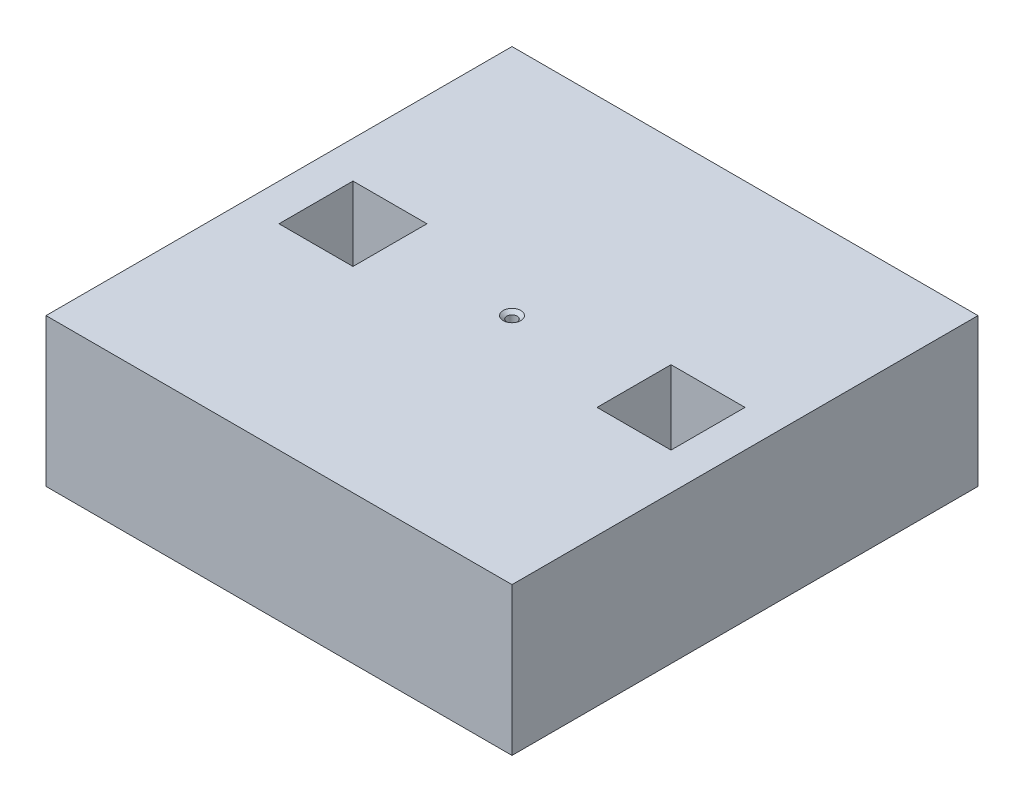
ISO-10303-21;
HEADER;
FILE_DESCRIPTION(('STEP AP214'),'2;1');
FILE_NAME('part.step','',(''),(''),'','','');
FILE_SCHEMA(('AUTOMOTIVE_DESIGN { 1 0 10303 214 1 1 1 1 }'));
ENDSEC;
DATA;
#1=APPLICATION_CONTEXT('core data for automotive mechanical design processes');
#2=APPLICATION_PROTOCOL_DEFINITION('international standard','automotive_design',2000,#1);
#3=PRODUCT_CONTEXT('',#1,'mechanical');
#4=PRODUCT('Part','Part','',(#3));
#5=PRODUCT_RELATED_PRODUCT_CATEGORY('part','',(#4));
#6=PRODUCT_DEFINITION_FORMATION('','',#4);
#7=PRODUCT_DEFINITION_CONTEXT('part definition',#1,'design');
#8=PRODUCT_DEFINITION('design','',#6,#7);
#9=PRODUCT_DEFINITION_SHAPE('','',#8);
#10=(LENGTH_UNIT() NAMED_UNIT(*) SI_UNIT(.MILLI.,.METRE.));
#11=(NAMED_UNIT(*) PLANE_ANGLE_UNIT() SI_UNIT($,.RADIAN.));
#12=(NAMED_UNIT(*) SI_UNIT($,.STERADIAN.) SOLID_ANGLE_UNIT());
#13=UNCERTAINTY_MEASURE_WITH_UNIT(LENGTH_MEASURE(1.E-05),#10,'distance_accuracy_value','');
#14=(GEOMETRIC_REPRESENTATION_CONTEXT(3) GLOBAL_UNCERTAINTY_ASSIGNED_CONTEXT((#13)) GLOBAL_UNIT_ASSIGNED_CONTEXT((#10,
#11,#12)) REPRESENTATION_CONTEXT('',''));
#15=CARTESIAN_POINT('',(0.,0.,0.));
#16=DIRECTION('',(0.,0.,1.));
#17=DIRECTION('',(1.,0.,0.));
#18=AXIS2_PLACEMENT_3D('',#15,#16,#17);
#19=CARTESIAN_POINT('',(0.,25.4,0.));
#20=DIRECTION('',(0.,1.,0.));
#21=DIRECTION('',(0.,0.,1.));
#22=AXIS2_PLACEMENT_3D('',#19,#20,#21);
#23=PLANE('',#22);
#24=CARTESIAN_POINT('',(0.,25.4,0.));
#25=DIRECTION('',(0.,1.,0.));
#26=DIRECTION('',(0.,0.,1.));
#27=AXIS2_PLACEMENT_3D('',#24,#25,#26);
#28=CIRCLE('',#27,1.5113);
#29=CARTESIAN_POINT('',(0.,25.4,1.5113));
#30=VERTEX_POINT('',#29);
#31=EDGE_CURVE('E312',#30,#30,#28,.T.);
#32=ORIENTED_EDGE('',*,*,#31,.F.);
#33=EDGE_LOOP('',(#32));
#34=FACE_BOUND('',#33,.T.);
#35=DIRECTION('',(0.,0.,-1.));
#36=VECTOR('',#35,1.);
#37=CARTESIAN_POINT('',(40.,25.4,-40.));
#38=LINE('',#37,#36);
#39=CARTESIAN_POINT('',(40.,25.4,40.));
#40=VERTEX_POINT('',#39);
#41=CARTESIAN_POINT('',(40.,25.4,-40.));
#42=VERTEX_POINT('',#41);
#43=EDGE_CURVE('E192',#40,#42,#38,.T.);
#44=ORIENTED_EDGE('',*,*,#43,.T.);
#45=DIRECTION('',(-1.,0.,0.));
#46=VECTOR('',#45,1.);
#47=CARTESIAN_POINT('',(-40.,25.4,-40.));
#48=LINE('',#47,#46);
#49=CARTESIAN_POINT('',(-40.,25.4,-40.));
#50=VERTEX_POINT('',#49);
#51=EDGE_CURVE('E195',#42,#50,#48,.T.);
#52=ORIENTED_EDGE('',*,*,#51,.T.);
#53=DIRECTION('',(0.,0.,1.));
#54=VECTOR('',#53,1.);
#55=CARTESIAN_POINT('',(-40.,25.4,-40.));
#56=LINE('',#55,#54);
#57=CARTESIAN_POINT('',(-40.,25.4,40.));
#58=VERTEX_POINT('',#57);
#59=EDGE_CURVE('E198',#50,#58,#56,.T.);
#60=ORIENTED_EDGE('',*,*,#59,.T.);
#61=DIRECTION('',(1.,0.,0.));
#62=VECTOR('',#61,1.);
#63=CARTESIAN_POINT('',(-40.,25.4,40.));
#64=LINE('',#63,#62);
#65=EDGE_CURVE('E200',#58,#40,#64,.T.);
#66=ORIENTED_EDGE('',*,*,#65,.T.);
#67=EDGE_LOOP('',(#44,#52,#60,#66));
#68=FACE_BOUND('',#67,.T.);
#69=DIRECTION('',(-1.,0.,0.));
#70=VECTOR('',#69,1.);
#71=CARTESIAN_POINT('',(-33.65,25.4,-6.35));
#72=LINE('',#71,#70);
#73=CARTESIAN_POINT('',(-20.95,25.4,-6.35));
#74=VERTEX_POINT('',#73);
#75=CARTESIAN_POINT('',(-33.65,25.4,-6.35));
#76=VERTEX_POINT('',#75);
#77=EDGE_CURVE('E163',#74,#76,#72,.T.);
#78=ORIENTED_EDGE('',*,*,#77,.F.);
#79=DIRECTION('',(0.,0.,-1.));
#80=VECTOR('',#79,1.);
#81=CARTESIAN_POINT('',(-20.95,25.4,6.35));
#82=LINE('',#81,#80);
#83=CARTESIAN_POINT('',(-20.95,25.4,6.35));
#84=VERTEX_POINT('',#83);
#85=EDGE_CURVE('E161',#84,#74,#82,.T.);
#86=ORIENTED_EDGE('',*,*,#85,.F.);
#87=DIRECTION('',(1.,0.,0.));
#88=VECTOR('',#87,1.);
#89=CARTESIAN_POINT('',(-33.65,25.4,6.35));
#90=LINE('',#89,#88);
#91=CARTESIAN_POINT('',(-33.65,25.4,6.35));
#92=VERTEX_POINT('',#91);
#93=EDGE_CURVE('E169',#92,#84,#90,.T.);
#94=ORIENTED_EDGE('',*,*,#93,.F.);
#95=DIRECTION('',(0.,0.,1.));
#96=VECTOR('',#95,1.);
#97=CARTESIAN_POINT('',(-33.65,25.4,6.35));
#98=LINE('',#97,#96);
#99=EDGE_CURVE('E166',#76,#92,#98,.T.);
#100=ORIENTED_EDGE('',*,*,#99,.F.);
#101=EDGE_LOOP('',(#78,#86,#94,#100));
#102=FACE_BOUND('',#101,.T.);
#103=DIRECTION('',(-1.,0.,0.));
#104=VECTOR('',#103,1.);
#105=CARTESIAN_POINT('',(20.95,25.4,-6.35));
#106=LINE('',#105,#104);
#107=CARTESIAN_POINT('',(33.65,25.4,-6.35));
#108=VERTEX_POINT('',#107);
#109=CARTESIAN_POINT('',(20.95,25.4,-6.35));
#110=VERTEX_POINT('',#109);
#111=EDGE_CURVE('E131',#108,#110,#106,.T.);
#112=ORIENTED_EDGE('',*,*,#111,.F.);
#113=DIRECTION('',(0.,0.,-1.));
#114=VECTOR('',#113,1.);
#115=CARTESIAN_POINT('',(33.65,25.4,-6.35));
#116=LINE('',#115,#114);
#117=CARTESIAN_POINT('',(33.65,25.4,6.35));
#118=VERTEX_POINT('',#117);
#119=EDGE_CURVE('E123',#118,#108,#116,.T.);
#120=ORIENTED_EDGE('',*,*,#119,.F.);
#121=DIRECTION('',(1.,0.,0.));
#122=VECTOR('',#121,1.);
#123=CARTESIAN_POINT('',(20.95,25.4,6.35));
#124=LINE('',#123,#122);
#125=CARTESIAN_POINT('',(20.95,25.4,6.35));
#126=VERTEX_POINT('',#125);
#127=EDGE_CURVE('E145',#126,#118,#124,.T.);
#128=ORIENTED_EDGE('',*,*,#127,.F.);
#129=DIRECTION('',(0.,0.,1.));
#130=VECTOR('',#129,1.);
#131=CARTESIAN_POINT('',(20.95,25.4,-6.35));
#132=LINE('',#131,#130);
#133=EDGE_CURVE('E143',#110,#126,#132,.T.);
#134=ORIENTED_EDGE('',*,*,#133,.F.);
#135=EDGE_LOOP('',(#112,#120,#128,#134));
#136=FACE_BOUND('',#135,.T.);
#137=ADVANCED_FACE('F34',(#34,#68,#102,#136),#23,.T.);
#138=CARTESIAN_POINT('',(0.,0.,0.));
#139=DIRECTION('',(0.,1.,0.));
#140=DIRECTION('',(0.,0.,1.));
#141=AXIS2_PLACEMENT_3D('',#138,#139,#140);
#142=PLANE('',#141);
#143=CARTESIAN_POINT('',(0.,0.,0.));
#144=DIRECTION('',(0.,1.,0.));
#145=DIRECTION('',(0.,0.,1.));
#146=AXIS2_PLACEMENT_3D('',#143,#144,#145);
#147=CIRCLE('',#146,0.888999999999994);
#148=CARTESIAN_POINT('',(0.,0.,0.888999999999994));
#149=VERTEX_POINT('',#148);
#150=EDGE_CURVE('E151',#149,#149,#147,.T.);
#151=ORIENTED_EDGE('',*,*,#150,.T.);
#152=EDGE_LOOP('',(#151));
#153=FACE_BOUND('',#152,.T.);
#154=DIRECTION('',(0.,0.,-1.));
#155=VECTOR('',#154,1.);
#156=CARTESIAN_POINT('',(-20.95,0.,6.35));
#157=LINE('',#156,#155);
#158=CARTESIAN_POINT('',(-20.95,0.,6.35));
#159=VERTEX_POINT('',#158);
#160=CARTESIAN_POINT('',(-20.95,0.,-6.35));
#161=VERTEX_POINT('',#160);
#162=EDGE_CURVE('E139',#159,#161,#157,.T.);
#163=ORIENTED_EDGE('',*,*,#162,.T.);
#164=DIRECTION('',(-1.,0.,0.));
#165=VECTOR('',#164,1.);
#166=CARTESIAN_POINT('',(-33.65,0.,-6.35));
#167=LINE('',#166,#165);
#168=CARTESIAN_POINT('',(-33.65,0.,-6.35));
#169=VERTEX_POINT('',#168);
#170=EDGE_CURVE('E174',#161,#169,#167,.T.);
#171=ORIENTED_EDGE('',*,*,#170,.T.);
#172=DIRECTION('',(0.,0.,1.));
#173=VECTOR('',#172,1.);
#174=CARTESIAN_POINT('',(-33.65,0.,6.35));
#175=LINE('',#174,#173);
#176=CARTESIAN_POINT('',(-33.65,0.,6.35));
#177=VERTEX_POINT('',#176);
#178=EDGE_CURVE('E177',#169,#177,#175,.T.);
#179=ORIENTED_EDGE('',*,*,#178,.T.);
#180=DIRECTION('',(1.,0.,0.));
#181=VECTOR('',#180,1.);
#182=CARTESIAN_POINT('',(-33.65,0.,6.35));
#183=LINE('',#182,#181);
#184=EDGE_CURVE('E164',#177,#159,#183,.T.);
#185=ORIENTED_EDGE('',*,*,#184,.T.);
#186=EDGE_LOOP('',(#163,#171,#179,#185));
#187=FACE_BOUND('',#186,.T.);
#188=DIRECTION('',(0.,0.,-1.));
#189=VECTOR('',#188,1.);
#190=CARTESIAN_POINT('',(40.,0.,-40.));
#191=LINE('',#190,#189);
#192=CARTESIAN_POINT('',(40.,0.,40.));
#193=VERTEX_POINT('',#192);
#194=CARTESIAN_POINT('',(40.,0.,-40.));
#195=VERTEX_POINT('',#194);
#196=EDGE_CURVE('E191',#193,#195,#191,.T.);
#197=ORIENTED_EDGE('',*,*,#196,.F.);
#198=DIRECTION('',(1.,0.,0.));
#199=VECTOR('',#198,1.);
#200=CARTESIAN_POINT('',(-40.,0.,40.));
#201=LINE('',#200,#199);
#202=CARTESIAN_POINT('',(-40.,0.,40.));
#203=VERTEX_POINT('',#202);
#204=EDGE_CURVE('E196',#203,#193,#201,.T.);
#205=ORIENTED_EDGE('',*,*,#204,.F.);
#206=DIRECTION('',(0.,0.,1.));
#207=VECTOR('',#206,1.);
#208=CARTESIAN_POINT('',(-40.,0.,-40.));
#209=LINE('',#208,#207);
#210=CARTESIAN_POINT('',(-40.,0.,-40.));
#211=VERTEX_POINT('',#210);
#212=EDGE_CURVE('E207',#211,#203,#209,.T.);
#213=ORIENTED_EDGE('',*,*,#212,.F.);
#214=DIRECTION('',(-1.,0.,0.));
#215=VECTOR('',#214,1.);
#216=CARTESIAN_POINT('',(-40.,0.,-40.));
#217=LINE('',#216,#215);
#218=EDGE_CURVE('E205',#195,#211,#217,.T.);
#219=ORIENTED_EDGE('',*,*,#218,.F.);
#220=EDGE_LOOP('',(#197,#205,#213,#219));
#221=FACE_BOUND('',#220,.T.);
#222=DIRECTION('',(0.,0.,-1.));
#223=VECTOR('',#222,1.);
#224=CARTESIAN_POINT('',(33.65,0.,-6.35));
#225=LINE('',#224,#223);
#226=CARTESIAN_POINT('',(33.65,0.,6.35));
#227=VERTEX_POINT('',#226);
#228=CARTESIAN_POINT('',(33.65,0.,-6.35));
#229=VERTEX_POINT('',#228);
#230=EDGE_CURVE('E57',#227,#229,#225,.T.);
#231=ORIENTED_EDGE('',*,*,#230,.T.);
#232=DIRECTION('',(-1.,0.,0.));
#233=VECTOR('',#232,1.);
#234=CARTESIAN_POINT('',(20.95,0.,-6.35));
#235=LINE('',#234,#233);
#236=CARTESIAN_POINT('',(20.95,0.,-6.35));
#237=VERTEX_POINT('',#236);
#238=EDGE_CURVE('E138',#229,#237,#235,.T.);
#239=ORIENTED_EDGE('',*,*,#238,.T.);
#240=DIRECTION('',(0.,0.,1.));
#241=VECTOR('',#240,1.);
#242=CARTESIAN_POINT('',(20.95,0.,-6.35));
#243=LINE('',#242,#241);
#244=CARTESIAN_POINT('',(20.95,0.,6.35));
#245=VERTEX_POINT('',#244);
#246=EDGE_CURVE('E153',#237,#245,#243,.T.);
#247=ORIENTED_EDGE('',*,*,#246,.T.);
#248=DIRECTION('',(1.,0.,0.));
#249=VECTOR('',#248,1.);
#250=CARTESIAN_POINT('',(20.95,0.,6.35));
#251=LINE('',#250,#249);
#252=EDGE_CURVE('E132',#245,#227,#251,.T.);
#253=ORIENTED_EDGE('',*,*,#252,.T.);
#254=EDGE_LOOP('',(#231,#239,#247,#253));
#255=FACE_BOUND('',#254,.T.);
#256=ADVANCED_FACE('F225',(#153,#187,#221,#255),#142,.F.);
#257=CARTESIAN_POINT('',(40.,25.4,-40.));
#258=DIRECTION('',(-1.,0.,0.));
#259=DIRECTION('',(0.,0.,1.));
#260=AXIS2_PLACEMENT_3D('',#257,#258,#259);
#261=PLANE('',#260);
#262=ORIENTED_EDGE('',*,*,#196,.T.);
#263=DIRECTION('',(0.,-1.,0.));
#264=VECTOR('',#263,1.);
#265=CARTESIAN_POINT('',(40.,25.4,-40.));
#266=LINE('',#265,#264);
#267=EDGE_CURVE('E11',#42,#195,#266,.T.);
#268=ORIENTED_EDGE('',*,*,#267,.F.);
#269=ORIENTED_EDGE('',*,*,#43,.F.);
#270=DIRECTION('',(0.,-1.,0.));
#271=VECTOR('',#270,1.);
#272=CARTESIAN_POINT('',(40.,25.4,40.));
#273=LINE('',#272,#271);
#274=EDGE_CURVE('E202',#40,#193,#273,.T.);
#275=ORIENTED_EDGE('',*,*,#274,.T.);
#276=EDGE_LOOP('',(#262,#268,#269,#275));
#277=FACE_BOUND('',#276,.T.);
#278=ADVANCED_FACE('F36',(#277),#261,.F.);
#279=CARTESIAN_POINT('',(-40.,25.4,-40.));
#280=DIRECTION('',(0.,0.,1.));
#281=DIRECTION('',(1.,0.,0.));
#282=AXIS2_PLACEMENT_3D('',#279,#280,#281);
#283=PLANE('',#282);
#284=ORIENTED_EDGE('',*,*,#218,.T.);
#285=DIRECTION('',(0.,-1.,0.));
#286=VECTOR('',#285,1.);
#287=CARTESIAN_POINT('',(-40.,25.4,-40.));
#288=LINE('',#287,#286);
#289=EDGE_CURVE('E42',#50,#211,#288,.T.);
#290=ORIENTED_EDGE('',*,*,#289,.F.);
#291=ORIENTED_EDGE('',*,*,#51,.F.);
#292=ORIENTED_EDGE('',*,*,#267,.T.);
#293=EDGE_LOOP('',(#284,#290,#291,#292));
#294=FACE_BOUND('',#293,.T.);
#295=ADVANCED_FACE('F236',(#294),#283,.F.);
#296=CARTESIAN_POINT('',(-40.,25.4,-40.));
#297=DIRECTION('',(1.,0.,0.));
#298=DIRECTION('',(0.,0.,-1.));
#299=AXIS2_PLACEMENT_3D('',#296,#297,#298);
#300=PLANE('',#299);
#301=ORIENTED_EDGE('',*,*,#212,.T.);
#302=DIRECTION('',(0.,-1.,0.));
#303=VECTOR('',#302,1.);
#304=CARTESIAN_POINT('',(-40.,25.4,40.));
#305=LINE('',#304,#303);
#306=EDGE_CURVE('E212',#58,#203,#305,.T.);
#307=ORIENTED_EDGE('',*,*,#306,.F.);
#308=ORIENTED_EDGE('',*,*,#59,.F.);
#309=ORIENTED_EDGE('',*,*,#289,.T.);
#310=EDGE_LOOP('',(#301,#307,#308,#309));
#311=FACE_BOUND('',#310,.T.);
#312=ADVANCED_FACE('F219',(#311),#300,.F.);
#313=CARTESIAN_POINT('',(-40.,25.4,40.));
#314=DIRECTION('',(0.,0.,-1.));
#315=DIRECTION('',(-1.,0.,0.));
#316=AXIS2_PLACEMENT_3D('',#313,#314,#315);
#317=PLANE('',#316);
#318=ORIENTED_EDGE('',*,*,#204,.T.);
#319=ORIENTED_EDGE('',*,*,#274,.F.);
#320=ORIENTED_EDGE('',*,*,#65,.F.);
#321=ORIENTED_EDGE('',*,*,#306,.T.);
#322=EDGE_LOOP('',(#318,#319,#320,#321));
#323=FACE_BOUND('',#322,.T.);
#324=ADVANCED_FACE('F229',(#323),#317,.F.);
#325=CARTESIAN_POINT('',(-20.95,25.4,6.35));
#326=DIRECTION('',(-1.,0.,0.));
#327=DIRECTION('',(0.,0.,1.));
#328=AXIS2_PLACEMENT_3D('',#325,#326,#327);
#329=PLANE('',#328);
#330=ORIENTED_EDGE('',*,*,#162,.F.);
#331=DIRECTION('',(0.,-1.,0.));
#332=VECTOR('',#331,1.);
#333=CARTESIAN_POINT('',(-20.95,25.4,6.35));
#334=LINE('',#333,#332);
#335=EDGE_CURVE('E171',#84,#159,#334,.T.);
#336=ORIENTED_EDGE('',*,*,#335,.F.);
#337=ORIENTED_EDGE('',*,*,#85,.T.);
#338=DIRECTION('',(0.,-1.,0.));
#339=VECTOR('',#338,1.);
#340=CARTESIAN_POINT('',(-20.95,25.4,-6.35));
#341=LINE('',#340,#339);
#342=EDGE_CURVE('E188',#74,#161,#341,.T.);
#343=ORIENTED_EDGE('',*,*,#342,.T.);
#344=EDGE_LOOP('',(#330,#336,#337,#343));
#345=FACE_BOUND('',#344,.T.);
#346=ADVANCED_FACE('F253',(#345),#329,.T.);
#347=CARTESIAN_POINT('',(-33.65,25.4,-6.35));
#348=DIRECTION('',(0.,0.,1.));
#349=DIRECTION('',(1.,0.,0.));
#350=AXIS2_PLACEMENT_3D('',#347,#348,#349);
#351=PLANE('',#350);
#352=ORIENTED_EDGE('',*,*,#170,.F.);
#353=ORIENTED_EDGE('',*,*,#342,.F.);
#354=ORIENTED_EDGE('',*,*,#77,.T.);
#355=DIRECTION('',(0.,-1.,0.));
#356=VECTOR('',#355,1.);
#357=CARTESIAN_POINT('',(-33.65,25.4,-6.35));
#358=LINE('',#357,#356);
#359=EDGE_CURVE('E186',#76,#169,#358,.T.);
#360=ORIENTED_EDGE('',*,*,#359,.T.);
#361=EDGE_LOOP('',(#352,#353,#354,#360));
#362=FACE_BOUND('',#361,.T.);
#363=ADVANCED_FACE('F260',(#362),#351,.T.);
#364=CARTESIAN_POINT('',(-33.65,25.4,6.35));
#365=DIRECTION('',(1.,0.,0.));
#366=DIRECTION('',(0.,0.,-1.));
#367=AXIS2_PLACEMENT_3D('',#364,#365,#366);
#368=PLANE('',#367);
#369=ORIENTED_EDGE('',*,*,#178,.F.);
#370=ORIENTED_EDGE('',*,*,#359,.F.);
#371=ORIENTED_EDGE('',*,*,#99,.T.);
#372=DIRECTION('',(0.,-1.,0.));
#373=VECTOR('',#372,1.);
#374=CARTESIAN_POINT('',(-33.65,25.4,6.35));
#375=LINE('',#374,#373);
#376=EDGE_CURVE('E184',#92,#177,#375,.T.);
#377=ORIENTED_EDGE('',*,*,#376,.T.);
#378=EDGE_LOOP('',(#369,#370,#371,#377));
#379=FACE_BOUND('',#378,.T.);
#380=ADVANCED_FACE('F265',(#379),#368,.T.);
#381=CARTESIAN_POINT('',(-33.65,25.4,6.35));
#382=DIRECTION('',(0.,0.,-1.));
#383=DIRECTION('',(-1.,0.,0.));
#384=AXIS2_PLACEMENT_3D('',#381,#382,#383);
#385=PLANE('',#384);
#386=ORIENTED_EDGE('',*,*,#184,.F.);
#387=ORIENTED_EDGE('',*,*,#376,.F.);
#388=ORIENTED_EDGE('',*,*,#93,.T.);
#389=ORIENTED_EDGE('',*,*,#335,.T.);
#390=EDGE_LOOP('',(#386,#387,#388,#389));
#391=FACE_BOUND('',#390,.T.);
#392=ADVANCED_FACE('F273',(#391),#385,.T.);
#393=CARTESIAN_POINT('',(33.65,25.4,-6.35));
#394=DIRECTION('',(-1.,0.,0.));
#395=DIRECTION('',(0.,0.,1.));
#396=AXIS2_PLACEMENT_3D('',#393,#394,#395);
#397=PLANE('',#396);
#398=ORIENTED_EDGE('',*,*,#230,.F.);
#399=DIRECTION('',(0.,-1.,0.));
#400=VECTOR('',#399,1.);
#401=CARTESIAN_POINT('',(33.65,25.4,6.35));
#402=LINE('',#401,#400);
#403=EDGE_CURVE('E127',#118,#227,#402,.T.);
#404=ORIENTED_EDGE('',*,*,#403,.F.);
#405=ORIENTED_EDGE('',*,*,#119,.T.);
#406=DIRECTION('',(0.,-1.,0.));
#407=VECTOR('',#406,1.);
#408=CARTESIAN_POINT('',(33.65,25.4,-6.35));
#409=LINE('',#408,#407);
#410=EDGE_CURVE('E126',#108,#229,#409,.T.);
#411=ORIENTED_EDGE('',*,*,#410,.T.);
#412=EDGE_LOOP('',(#398,#404,#405,#411));
#413=FACE_BOUND('',#412,.T.);
#414=ADVANCED_FACE('F125',(#413),#397,.T.);
#415=CARTESIAN_POINT('',(20.95,25.4,-6.35));
#416=DIRECTION('',(0.,0.,1.));
#417=DIRECTION('',(1.,0.,0.));
#418=AXIS2_PLACEMENT_3D('',#415,#416,#417);
#419=PLANE('',#418);
#420=ORIENTED_EDGE('',*,*,#238,.F.);
#421=ORIENTED_EDGE('',*,*,#410,.F.);
#422=ORIENTED_EDGE('',*,*,#111,.T.);
#423=DIRECTION('',(0.,-1.,0.));
#424=VECTOR('',#423,1.);
#425=CARTESIAN_POINT('',(20.95,25.4,-6.35));
#426=LINE('',#425,#424);
#427=EDGE_CURVE('E140',#110,#237,#426,.T.);
#428=ORIENTED_EDGE('',*,*,#427,.T.);
#429=EDGE_LOOP('',(#420,#421,#422,#428));
#430=FACE_BOUND('',#429,.T.);
#431=ADVANCED_FACE('F135',(#430),#419,.T.);
#432=CARTESIAN_POINT('',(20.95,25.4,-6.35));
#433=DIRECTION('',(1.,0.,0.));
#434=DIRECTION('',(0.,0.,-1.));
#435=AXIS2_PLACEMENT_3D('',#432,#433,#434);
#436=PLANE('',#435);
#437=ORIENTED_EDGE('',*,*,#246,.F.);
#438=ORIENTED_EDGE('',*,*,#427,.F.);
#439=ORIENTED_EDGE('',*,*,#133,.T.);
#440=DIRECTION('',(0.,-1.,0.));
#441=VECTOR('',#440,1.);
#442=CARTESIAN_POINT('',(20.95,25.4,6.35));
#443=LINE('',#442,#441);
#444=EDGE_CURVE('E49',#126,#245,#443,.T.);
#445=ORIENTED_EDGE('',*,*,#444,.T.);
#446=EDGE_LOOP('',(#437,#438,#439,#445));
#447=FACE_BOUND('',#446,.T.);
#448=ADVANCED_FACE('F291',(#447),#436,.T.);
#449=CARTESIAN_POINT('',(20.95,25.4,6.35));
#450=DIRECTION('',(0.,0.,-1.));
#451=DIRECTION('',(-1.,0.,0.));
#452=AXIS2_PLACEMENT_3D('',#449,#450,#451);
#453=PLANE('',#452);
#454=ORIENTED_EDGE('',*,*,#252,.F.);
#455=ORIENTED_EDGE('',*,*,#444,.F.);
#456=ORIENTED_EDGE('',*,*,#127,.T.);
#457=ORIENTED_EDGE('',*,*,#403,.T.);
#458=EDGE_LOOP('',(#454,#455,#456,#457));
#459=FACE_BOUND('',#458,.T.);
#460=ADVANCED_FACE('F294',(#459),#453,.T.);
#461=CARTESIAN_POINT('',(0.,25.4,0.));
#462=DIRECTION('',(0.,1.,0.));
#463=DIRECTION('',(0.,0.,1.));
#464=AXIS2_PLACEMENT_3D('',#461,#462,#463);
#465=CYLINDRICAL_SURFACE('',#464,0.888999999999991);
#466=ORIENTED_EDGE('',*,*,#150,.F.);
#467=EDGE_LOOP('',(#466));
#468=FACE_BOUND('',#467,.T.);
#469=CARTESIAN_POINT('',(0.,24.8778282995184,0.));
#470=DIRECTION('',(0.,1.,0.));
#471=DIRECTION('',(0.,0.,1.));
#472=AXIS2_PLACEMENT_3D('',#469,#470,#471);
#473=CIRCLE('',#472,0.888999999999987);
#474=CARTESIAN_POINT('',(0.,24.8778282995184,0.888999999999987));
#475=VERTEX_POINT('',#474);
#476=EDGE_CURVE('E310',#475,#475,#473,.T.);
#477=ORIENTED_EDGE('',*,*,#476,.T.);
#478=EDGE_LOOP('',(#477));
#479=FACE_BOUND('',#478,.T.);
#480=ADVANCED_FACE('F298',(#468,#479),#465,.F.);
#481=CARTESIAN_POINT('',(0.,25.4,0.));
#482=DIRECTION('',(0.,1.,0.));
#483=DIRECTION('',(0.,0.,1.));
#484=AXIS2_PLACEMENT_3D('',#481,#482,#483);
#485=CONICAL_SURFACE('',#484,1.5113,0.872664625997174);
#486=ORIENTED_EDGE('',*,*,#476,.F.);
#487=EDGE_LOOP('',(#486));
#488=FACE_BOUND('',#487,.T.);
#489=ORIENTED_EDGE('',*,*,#31,.T.);
#490=EDGE_LOOP('',(#489));
#491=FACE_BOUND('',#490,.T.);
#492=ADVANCED_FACE('F301',(#488,#491),#485,.F.);
#493=CLOSED_SHELL('',(#137,#256,#278,#295,#312,#324,#346,#363,#380,#392,#414,#431,#448,#460,
#480,#492));
#494=MANIFOLD_SOLID_BREP('B2',#493);
#495=ADVANCED_BREP_SHAPE_REPRESENTATION('',(#18,#494),#14);
#496=SHAPE_DEFINITION_REPRESENTATION(#9,#495);
ENDSEC;
END-ISO-10303-21;
